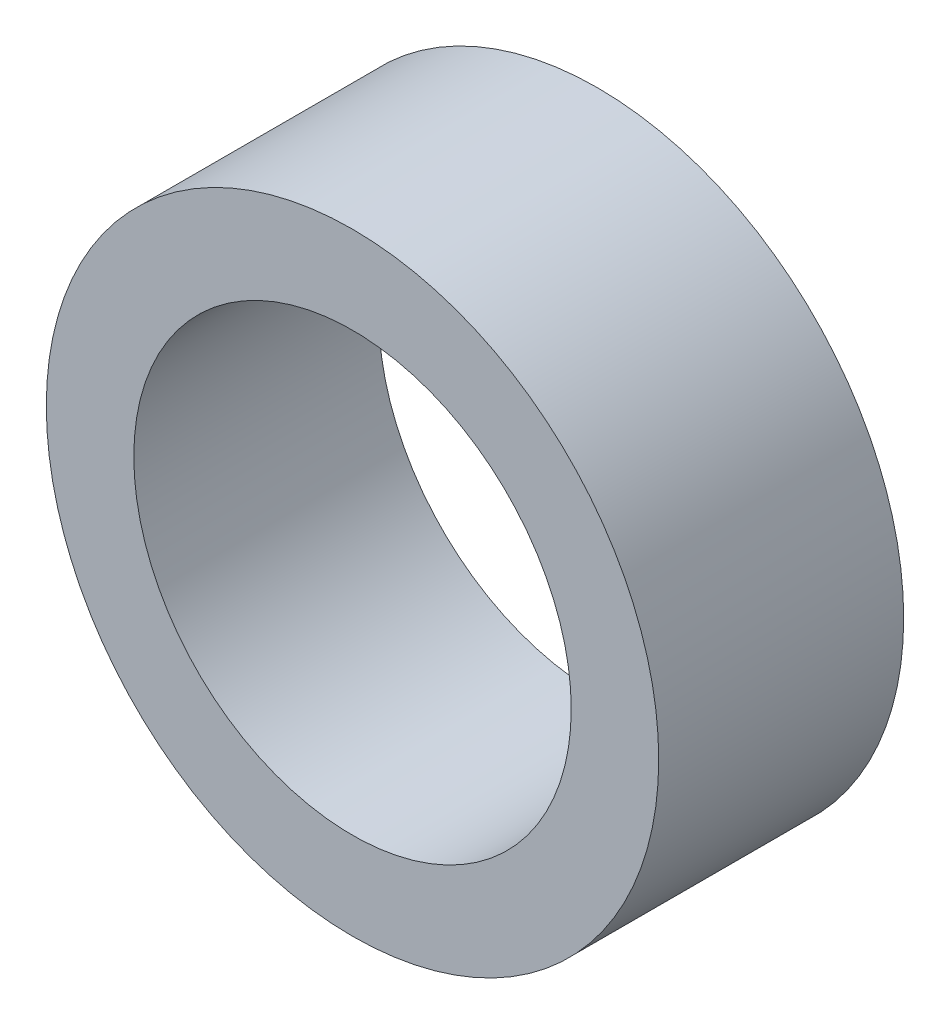
ISO-10303-21;
HEADER;
FILE_DESCRIPTION(('STEP AP214'),'2;1');
FILE_NAME('part.step','',(''),(''),'','','');
FILE_SCHEMA(('AUTOMOTIVE_DESIGN { 1 0 10303 214 1 1 1 1 }'));
ENDSEC;
DATA;
#1=APPLICATION_CONTEXT('core data for automotive mechanical design processes');
#2=APPLICATION_PROTOCOL_DEFINITION('international standard','automotive_design',2000,#1);
#3=PRODUCT_CONTEXT('',#1,'mechanical');
#4=PRODUCT('Part','Part','',(#3));
#5=PRODUCT_RELATED_PRODUCT_CATEGORY('part','',(#4));
#6=PRODUCT_DEFINITION_FORMATION('','',#4);
#7=PRODUCT_DEFINITION_CONTEXT('part definition',#1,'design');
#8=PRODUCT_DEFINITION('design','',#6,#7);
#9=PRODUCT_DEFINITION_SHAPE('','',#8);
#10=(LENGTH_UNIT() NAMED_UNIT(*) SI_UNIT(.MILLI.,.METRE.));
#11=(NAMED_UNIT(*) PLANE_ANGLE_UNIT() SI_UNIT($,.RADIAN.));
#12=(NAMED_UNIT(*) SI_UNIT($,.STERADIAN.) SOLID_ANGLE_UNIT());
#13=UNCERTAINTY_MEASURE_WITH_UNIT(LENGTH_MEASURE(1.E-05),#10,'distance_accuracy_value','');
#14=(GEOMETRIC_REPRESENTATION_CONTEXT(3) GLOBAL_UNCERTAINTY_ASSIGNED_CONTEXT((#13)) GLOBAL_UNIT_ASSIGNED_CONTEXT((#10,
#11,#12)) REPRESENTATION_CONTEXT('',''));
#15=CARTESIAN_POINT('',(0.,0.,0.));
#16=DIRECTION('',(0.,0.,1.));
#17=DIRECTION('',(1.,0.,0.));
#18=AXIS2_PLACEMENT_3D('',#15,#16,#17);
#19=CARTESIAN_POINT('',(0.,0.,2.8));
#20=DIRECTION('',(0.,0.,1.));
#21=DIRECTION('',(1.,0.,0.));
#22=AXIS2_PLACEMENT_3D('',#19,#20,#21);
#23=PLANE('',#22);
#24=CARTESIAN_POINT('',(0.,0.,2.8));
#25=DIRECTION('',(0.,0.,1.));
#26=DIRECTION('',(1.,0.,0.));
#27=AXIS2_PLACEMENT_3D('',#24,#25,#26);
#28=CIRCLE('',#27,3.5);
#29=CARTESIAN_POINT('',(3.5,0.,2.8));
#30=VERTEX_POINT('',#29);
#31=EDGE_CURVE('E10',#30,#30,#28,.T.);
#32=ORIENTED_EDGE('',*,*,#31,.T.);
#33=EDGE_LOOP('',(#32));
#34=FACE_BOUND('',#33,.T.);
#35=CARTESIAN_POINT('',(0.,0.,2.8));
#36=DIRECTION('',(0.,0.,1.));
#37=DIRECTION('',(1.,0.,0.));
#38=AXIS2_PLACEMENT_3D('',#35,#36,#37);
#39=CIRCLE('',#38,2.5);
#40=CARTESIAN_POINT('',(2.5,0.,2.8));
#41=VERTEX_POINT('',#40);
#42=EDGE_CURVE('E44',#41,#41,#39,.T.);
#43=ORIENTED_EDGE('',*,*,#42,.F.);
#44=EDGE_LOOP('',(#43));
#45=FACE_BOUND('',#44,.T.);
#46=ADVANCED_FACE('F33',(#34,#45),#23,.T.);
#47=CARTESIAN_POINT('',(0.,0.,0.));
#48=DIRECTION('',(0.,0.,1.));
#49=DIRECTION('',(1.,0.,0.));
#50=AXIS2_PLACEMENT_3D('',#47,#48,#49);
#51=PLANE('',#50);
#52=CARTESIAN_POINT('',(0.,0.,0.));
#53=DIRECTION('',(0.,0.,1.));
#54=DIRECTION('',(1.,0.,0.));
#55=AXIS2_PLACEMENT_3D('',#52,#53,#54);
#56=CIRCLE('',#55,3.5);
#57=CARTESIAN_POINT('',(3.5,0.,0.));
#58=VERTEX_POINT('',#57);
#59=EDGE_CURVE('E37',#58,#58,#56,.T.);
#60=ORIENTED_EDGE('',*,*,#59,.F.);
#61=EDGE_LOOP('',(#60));
#62=FACE_BOUND('',#61,.T.);
#63=CARTESIAN_POINT('',(0.,0.,0.));
#64=DIRECTION('',(0.,0.,1.));
#65=DIRECTION('',(1.,0.,0.));
#66=AXIS2_PLACEMENT_3D('',#63,#64,#65);
#67=CIRCLE('',#66,2.5);
#68=CARTESIAN_POINT('',(2.5,0.,0.));
#69=VERTEX_POINT('',#68);
#70=EDGE_CURVE('E46',#69,#69,#67,.T.);
#71=ORIENTED_EDGE('',*,*,#70,.T.);
#72=EDGE_LOOP('',(#71));
#73=FACE_BOUND('',#72,.T.);
#74=ADVANCED_FACE('F56',(#62,#73),#51,.F.);
#75=CARTESIAN_POINT('',(0.,0.,2.8));
#76=DIRECTION('',(0.,0.,-1.));
#77=DIRECTION('',(-1.,0.,0.));
#78=AXIS2_PLACEMENT_3D('',#75,#76,#77);
#79=CYLINDRICAL_SURFACE('',#78,3.5);
#80=ORIENTED_EDGE('',*,*,#31,.F.);
#81=EDGE_LOOP('',(#80));
#82=FACE_BOUND('',#81,.T.);
#83=ORIENTED_EDGE('',*,*,#59,.T.);
#84=EDGE_LOOP('',(#83));
#85=FACE_BOUND('',#84,.T.);
#86=ADVANCED_FACE('F35',(#82,#85),#79,.T.);
#87=CARTESIAN_POINT('',(0.,0.,2.8));
#88=DIRECTION('',(0.,0.,-1.));
#89=DIRECTION('',(-1.,0.,0.));
#90=AXIS2_PLACEMENT_3D('',#87,#88,#89);
#91=CYLINDRICAL_SURFACE('',#90,2.5);
#92=ORIENTED_EDGE('',*,*,#42,.T.);
#93=EDGE_LOOP('',(#92));
#94=FACE_BOUND('',#93,.T.);
#95=ORIENTED_EDGE('',*,*,#70,.F.);
#96=EDGE_LOOP('',(#95));
#97=FACE_BOUND('',#96,.T.);
#98=ADVANCED_FACE('F52',(#94,#97),#91,.F.);
#99=CLOSED_SHELL('',(#46,#74,#86,#98));
#100=MANIFOLD_SOLID_BREP('B2',#99);
#101=ADVANCED_BREP_SHAPE_REPRESENTATION('',(#18,#100),#14);
#102=SHAPE_DEFINITION_REPRESENTATION(#9,#101);
ENDSEC;
END-ISO-10303-21;
